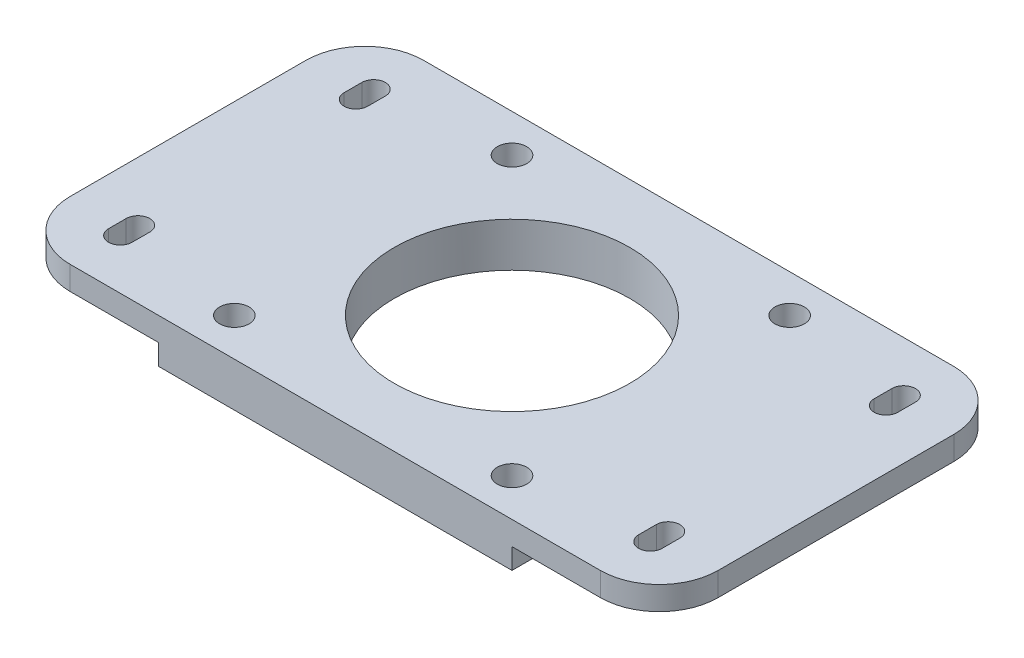
ISO-10303-21;
HEADER;
FILE_DESCRIPTION(('STEP AP214'),'2;1');
FILE_NAME('part.step','',(''),(''),'','','');
FILE_SCHEMA(('AUTOMOTIVE_DESIGN { 1 0 10303 214 1 1 1 1 }'));
ENDSEC;
DATA;
#1=APPLICATION_CONTEXT('core data for automotive mechanical design processes');
#2=APPLICATION_PROTOCOL_DEFINITION('international standard','automotive_design',2000,#1);
#3=PRODUCT_CONTEXT('',#1,'mechanical');
#4=PRODUCT('Part','Part','',(#3));
#5=PRODUCT_RELATED_PRODUCT_CATEGORY('part','',(#4));
#6=PRODUCT_DEFINITION_FORMATION('','',#4);
#7=PRODUCT_DEFINITION_CONTEXT('part definition',#1,'design');
#8=PRODUCT_DEFINITION('design','',#6,#7);
#9=PRODUCT_DEFINITION_SHAPE('','',#8);
#10=(LENGTH_UNIT() NAMED_UNIT(*) SI_UNIT(.MILLI.,.METRE.));
#11=(NAMED_UNIT(*) PLANE_ANGLE_UNIT() SI_UNIT($,.RADIAN.));
#12=(NAMED_UNIT(*) SI_UNIT($,.STERADIAN.) SOLID_ANGLE_UNIT());
#13=UNCERTAINTY_MEASURE_WITH_UNIT(LENGTH_MEASURE(1.E-05),#10,'distance_accuracy_value','');
#14=(GEOMETRIC_REPRESENTATION_CONTEXT(3) GLOBAL_UNCERTAINTY_ASSIGNED_CONTEXT((#13)) GLOBAL_UNIT_ASSIGNED_CONTEXT((#10,
#11,#12)) REPRESENTATION_CONTEXT('',''));
#15=CARTESIAN_POINT('',(0.,0.,0.));
#16=DIRECTION('',(0.,0.,1.));
#17=DIRECTION('',(1.,0.,0.));
#18=AXIS2_PLACEMENT_3D('',#15,#16,#17);
#19=CARTESIAN_POINT('',(0.,0.,0.));
#20=DIRECTION('',(0.,-1.,0.));
#21=DIRECTION('',(0.,0.,-1.));
#22=AXIS2_PLACEMENT_3D('',#19,#20,#21);
#23=PLANE('',#22);
#24=CARTESIAN_POINT('',(-23.57,0.,23.5699999999967));
#25=DIRECTION('',(0.,-1.,0.));
#26=DIRECTION('',(0.,0.,-1.));
#27=AXIS2_PLACEMENT_3D('',#24,#25,#26);
#28=CIRCLE('',#27,2.5);
#29=CARTESIAN_POINT('',(-23.57,0.,21.0699999999967));
#30=VERTEX_POINT('',#29);
#31=EDGE_CURVE('E594',#30,#30,#28,.T.);
#32=ORIENTED_EDGE('',*,*,#31,.F.);
#33=EDGE_LOOP('',(#32));
#34=FACE_BOUND('',#33,.T.);
#35=CARTESIAN_POINT('',(23.57,0.,23.5699999999967));
#36=DIRECTION('',(0.,-1.,0.));
#37=DIRECTION('',(0.,0.,-1.));
#38=AXIS2_PLACEMENT_3D('',#35,#36,#37);
#39=CIRCLE('',#38,2.5);
#40=CARTESIAN_POINT('',(23.57,0.,21.0699999999967));
#41=VERTEX_POINT('',#40);
#42=EDGE_CURVE('E596',#41,#41,#39,.T.);
#43=ORIENTED_EDGE('',*,*,#42,.F.);
#44=EDGE_LOOP('',(#43));
#45=FACE_BOUND('',#44,.T.);
#46=CARTESIAN_POINT('',(23.57,0.,-23.5700000000033));
#47=DIRECTION('',(0.,-1.,0.));
#48=DIRECTION('',(0.,0.,-1.));
#49=AXIS2_PLACEMENT_3D('',#46,#47,#48);
#50=CIRCLE('',#49,2.5);
#51=CARTESIAN_POINT('',(23.57,0.,-26.0700000000033));
#52=VERTEX_POINT('',#51);
#53=EDGE_CURVE('E601',#52,#52,#50,.T.);
#54=ORIENTED_EDGE('',*,*,#53,.F.);
#55=EDGE_LOOP('',(#54));
#56=FACE_BOUND('',#55,.T.);
#57=CARTESIAN_POINT('',(-23.57,0.,-23.5700000000033));
#58=DIRECTION('',(0.,-1.,0.));
#59=DIRECTION('',(0.,0.,-1.));
#60=AXIS2_PLACEMENT_3D('',#57,#58,#59);
#61=CIRCLE('',#60,2.5);
#62=CARTESIAN_POINT('',(-23.57,0.,-26.0700000000033));
#63=VERTEX_POINT('',#62);
#64=EDGE_CURVE('E604',#63,#63,#61,.T.);
#65=ORIENTED_EDGE('',*,*,#64,.F.);
#66=EDGE_LOOP('',(#65));
#67=FACE_BOUND('',#66,.T.);
#68=DIRECTION('',(0.,0.,-1.));
#69=VECTOR('',#68,1.);
#70=CARTESIAN_POINT('',(30.,0.,30.));
#71=LINE('',#70,#69);
#72=CARTESIAN_POINT('',(30.,0.,30.));
#73=VERTEX_POINT('',#72);
#74=CARTESIAN_POINT('',(30.,0.,-30.));
#75=VERTEX_POINT('',#74);
#76=EDGE_CURVE('E633',#73,#75,#71,.T.);
#77=ORIENTED_EDGE('',*,*,#76,.F.);
#78=DIRECTION('',(1.,0.,0.));
#79=VECTOR('',#78,1.);
#80=CARTESIAN_POINT('',(-30.,0.,30.));
#81=LINE('',#80,#79);
#82=CARTESIAN_POINT('',(-30.,0.,30.));
#83=VERTEX_POINT('',#82);
#84=EDGE_CURVE('E74',#83,#73,#81,.T.);
#85=ORIENTED_EDGE('',*,*,#84,.F.);
#86=DIRECTION('',(0.,0.,1.));
#87=VECTOR('',#86,1.);
#88=CARTESIAN_POINT('',(-30.,0.,30.));
#89=LINE('',#88,#87);
#90=CARTESIAN_POINT('',(-30.,0.,-30.));
#91=VERTEX_POINT('',#90);
#92=EDGE_CURVE('E71',#91,#83,#89,.T.);
#93=ORIENTED_EDGE('',*,*,#92,.F.);
#94=DIRECTION('',(-1.,0.,0.));
#95=VECTOR('',#94,1.);
#96=CARTESIAN_POINT('',(-30.,0.,-30.));
#97=LINE('',#96,#95);
#98=EDGE_CURVE('E636',#75,#91,#97,.T.);
#99=ORIENTED_EDGE('',*,*,#98,.F.);
#100=EDGE_LOOP('',(#77,#85,#93,#99));
#101=FACE_BOUND('',#100,.T.);
#102=CARTESIAN_POINT('',(0.,0.,0.));
#103=DIRECTION('',(0.,1.,0.));
#104=DIRECTION('',(0.,0.,1.));
#105=AXIS2_PLACEMENT_3D('',#102,#103,#104);
#106=CIRCLE('',#105,20.);
#107=CARTESIAN_POINT('',(0.,0.,20.));
#108=VERTEX_POINT('',#107);
#109=EDGE_CURVE('E427',#108,#108,#106,.T.);
#110=ORIENTED_EDGE('',*,*,#109,.T.);
#111=EDGE_LOOP('',(#110));
#112=FACE_BOUND('',#111,.T.);
#113=ADVANCED_FACE('F33',(#34,#45,#56,#67,#101,#112),#23,.T.);
#114=CARTESIAN_POINT('',(30.,3.5,30.));
#115=DIRECTION('',(-1.,0.,0.));
#116=DIRECTION('',(0.,0.,1.));
#117=AXIS2_PLACEMENT_3D('',#114,#115,#116);
#118=PLANE('',#117);
#119=ORIENTED_EDGE('',*,*,#76,.T.);
#120=DIRECTION('',(0.,-1.,0.));
#121=VECTOR('',#120,1.);
#122=CARTESIAN_POINT('',(30.,3.5,-30.));
#123=LINE('',#122,#121);
#124=CARTESIAN_POINT('',(30.,3.5,-30.));
#125=VERTEX_POINT('',#124);
#126=EDGE_CURVE('E11',#125,#75,#123,.T.);
#127=ORIENTED_EDGE('',*,*,#126,.F.);
#128=DIRECTION('',(0.,0.,-1.));
#129=VECTOR('',#128,1.);
#130=CARTESIAN_POINT('',(30.,3.5,30.));
#131=LINE('',#130,#129);
#132=CARTESIAN_POINT('',(30.,3.5,30.));
#133=VERTEX_POINT('',#132);
#134=EDGE_CURVE('E643',#133,#125,#131,.T.);
#135=ORIENTED_EDGE('',*,*,#134,.F.);
#136=DIRECTION('',(0.,-1.,0.));
#137=VECTOR('',#136,1.);
#138=CARTESIAN_POINT('',(30.,3.5,30.));
#139=LINE('',#138,#137);
#140=EDGE_CURVE('E52',#133,#73,#139,.T.);
#141=ORIENTED_EDGE('',*,*,#140,.T.);
#142=EDGE_LOOP('',(#119,#127,#135,#141));
#143=FACE_BOUND('',#142,.T.);
#144=ADVANCED_FACE('F35',(#143),#118,.F.);
#145=CARTESIAN_POINT('',(-30.,3.5,-30.));
#146=DIRECTION('',(0.,0.,1.));
#147=DIRECTION('',(1.,0.,0.));
#148=AXIS2_PLACEMENT_3D('',#145,#146,#147);
#149=PLANE('',#148);
#150=ORIENTED_EDGE('',*,*,#98,.T.);
#151=DIRECTION('',(0.,-1.,0.));
#152=VECTOR('',#151,1.);
#153=CARTESIAN_POINT('',(-30.,3.5,-30.));
#154=LINE('',#153,#152);
#155=CARTESIAN_POINT('',(-30.,3.5,-30.));
#156=VERTEX_POINT('',#155);
#157=EDGE_CURVE('E43',#156,#91,#154,.T.);
#158=ORIENTED_EDGE('',*,*,#157,.F.);
#159=DIRECTION('',(1.,0.,0.));
#160=VECTOR('',#159,1.);
#161=CARTESIAN_POINT('',(45.,3.5,-30.));
#162=LINE('',#161,#160);
#163=CARTESIAN_POINT('',(-45.,3.5,-30.));
#164=VERTEX_POINT('',#163);
#165=EDGE_CURVE('E407',#164,#156,#162,.T.);
#166=ORIENTED_EDGE('',*,*,#165,.F.);
#167=DIRECTION('',(0.,-1.,0.));
#168=VECTOR('',#167,1.);
#169=CARTESIAN_POINT('',(-45.,7.5,-30.));
#170=LINE('',#169,#168);
#171=CARTESIAN_POINT('',(-45.,7.5,-30.));
#172=VERTEX_POINT('',#171);
#173=EDGE_CURVE('E395',#172,#164,#170,.T.);
#174=ORIENTED_EDGE('',*,*,#173,.F.);
#175=DIRECTION('',(1.,0.,0.));
#176=VECTOR('',#175,1.);
#177=CARTESIAN_POINT('',(45.,7.5,-30.));
#178=LINE('',#177,#176);
#179=CARTESIAN_POINT('',(45.,7.5,-30.));
#180=VERTEX_POINT('',#179);
#181=EDGE_CURVE('E373',#172,#180,#178,.T.);
#182=ORIENTED_EDGE('',*,*,#181,.T.);
#183=DIRECTION('',(0.,-1.,0.));
#184=VECTOR('',#183,1.);
#185=CARTESIAN_POINT('',(45.,7.5,-30.));
#186=LINE('',#185,#184);
#187=CARTESIAN_POINT('',(45.,3.5,-30.));
#188=VERTEX_POINT('',#187);
#189=EDGE_CURVE('E411',#180,#188,#186,.T.);
#190=ORIENTED_EDGE('',*,*,#189,.T.);
#191=EDGE_CURVE('E398',#125,#188,#162,.T.);
#192=ORIENTED_EDGE('',*,*,#191,.F.);
#193=ORIENTED_EDGE('',*,*,#126,.T.);
#194=EDGE_LOOP('',(#150,#158,#166,#174,#182,#190,#192,#193));
#195=FACE_BOUND('',#194,.T.);
#196=ADVANCED_FACE('F476',(#195),#149,.F.);
#197=CARTESIAN_POINT('',(-30.,3.5,30.));
#198=DIRECTION('',(1.,0.,0.));
#199=DIRECTION('',(0.,0.,-1.));
#200=AXIS2_PLACEMENT_3D('',#197,#198,#199);
#201=PLANE('',#200);
#202=ORIENTED_EDGE('',*,*,#92,.T.);
#203=DIRECTION('',(0.,-1.,0.));
#204=VECTOR('',#203,1.);
#205=CARTESIAN_POINT('',(-30.,3.5,30.));
#206=LINE('',#205,#204);
#207=CARTESIAN_POINT('',(-30.,3.5,30.));
#208=VERTEX_POINT('',#207);
#209=EDGE_CURVE('E651',#208,#83,#206,.T.);
#210=ORIENTED_EDGE('',*,*,#209,.F.);
#211=DIRECTION('',(0.,0.,1.));
#212=VECTOR('',#211,1.);
#213=CARTESIAN_POINT('',(-30.,3.5,30.));
#214=LINE('',#213,#212);
#215=EDGE_CURVE('E645',#156,#208,#214,.T.);
#216=ORIENTED_EDGE('',*,*,#215,.F.);
#217=ORIENTED_EDGE('',*,*,#157,.T.);
#218=EDGE_LOOP('',(#202,#210,#216,#217));
#219=FACE_BOUND('',#218,.T.);
#220=ADVANCED_FACE('F468',(#219),#201,.F.);
#221=CARTESIAN_POINT('',(-30.,3.5,30.));
#222=DIRECTION('',(0.,0.,-1.));
#223=DIRECTION('',(-1.,0.,0.));
#224=AXIS2_PLACEMENT_3D('',#221,#222,#223);
#225=PLANE('',#224);
#226=ORIENTED_EDGE('',*,*,#84,.T.);
#227=ORIENTED_EDGE('',*,*,#140,.F.);
#228=DIRECTION('',(-1.,0.,0.));
#229=VECTOR('',#228,1.);
#230=CARTESIAN_POINT('',(-45.,3.5,30.));
#231=LINE('',#230,#229);
#232=CARTESIAN_POINT('',(45.,3.5,30.));
#233=VERTEX_POINT('',#232);
#234=EDGE_CURVE('E433',#233,#133,#231,.T.);
#235=ORIENTED_EDGE('',*,*,#234,.F.);
#236=DIRECTION('',(0.,-1.,0.));
#237=VECTOR('',#236,1.);
#238=CARTESIAN_POINT('',(45.,7.5,30.));
#239=LINE('',#238,#237);
#240=CARTESIAN_POINT('',(45.,7.5,30.));
#241=VERTEX_POINT('',#240);
#242=EDGE_CURVE('E418',#241,#233,#239,.T.);
#243=ORIENTED_EDGE('',*,*,#242,.F.);
#244=DIRECTION('',(-1.,0.,0.));
#245=VECTOR('',#244,1.);
#246=CARTESIAN_POINT('',(-45.,7.5,30.));
#247=LINE('',#246,#245);
#248=CARTESIAN_POINT('',(-45.,7.5,30.));
#249=VERTEX_POINT('',#248);
#250=EDGE_CURVE('E386',#241,#249,#247,.T.);
#251=ORIENTED_EDGE('',*,*,#250,.T.);
#252=DIRECTION('',(0.,-1.,0.));
#253=VECTOR('',#252,1.);
#254=CARTESIAN_POINT('',(-45.,7.5,30.));
#255=LINE('',#254,#253);
#256=CARTESIAN_POINT('',(-45.,3.5,30.));
#257=VERTEX_POINT('',#256);
#258=EDGE_CURVE('E420',#249,#257,#255,.T.);
#259=ORIENTED_EDGE('',*,*,#258,.T.);
#260=EDGE_CURVE('E439',#208,#257,#231,.T.);
#261=ORIENTED_EDGE('',*,*,#260,.F.);
#262=ORIENTED_EDGE('',*,*,#209,.T.);
#263=EDGE_LOOP('',(#226,#227,#235,#243,#251,#259,#261,#262));
#264=FACE_BOUND('',#263,.T.);
#265=ADVANCED_FACE('F465',(#264),#225,.F.);
#266=CARTESIAN_POINT('',(0.,3.5,0.));
#267=DIRECTION('',(0.,-1.,0.));
#268=DIRECTION('',(0.,0.,-1.));
#269=AXIS2_PLACEMENT_3D('',#266,#267,#268);
#270=CYLINDRICAL_SURFACE('',#269,20.);
#271=ORIENTED_EDGE('',*,*,#109,.F.);
#272=EDGE_LOOP('',(#271));
#273=FACE_BOUND('',#272,.T.);
#274=CARTESIAN_POINT('',(0.,7.5,0.));
#275=DIRECTION('',(0.,-1.,0.));
#276=DIRECTION('',(0.,0.,-1.));
#277=AXIS2_PLACEMENT_3D('',#274,#275,#276);
#278=CIRCLE('',#277,20.);
#279=CARTESIAN_POINT('',(0.,7.5,-20.));
#280=VERTEX_POINT('',#279);
#281=EDGE_CURVE('E258',#280,#280,#278,.T.);
#282=ORIENTED_EDGE('',*,*,#281,.F.);
#283=EDGE_LOOP('',(#282));
#284=FACE_BOUND('',#283,.T.);
#285=ADVANCED_FACE('F467',(#273,#284),#270,.F.);
#286=CARTESIAN_POINT('',(-45.,3.5,-20.));
#287=DIRECTION('',(0.,1.,0.));
#288=DIRECTION('',(0.,0.,1.));
#289=AXIS2_PLACEMENT_3D('',#286,#287,#288);
#290=PLANE('',#289);
#291=DIRECTION('',(0.,0.,1.));
#292=VECTOR('',#291,1.);
#293=CARTESIAN_POINT('',(47.,3.5,-18.5));
#294=LINE('',#293,#292);
#295=CARTESIAN_POINT('',(47.,3.5,-21.5));
#296=VERTEX_POINT('',#295);
#297=CARTESIAN_POINT('',(47.,3.5,-18.5));
#298=VERTEX_POINT('',#297);
#299=EDGE_CURVE('E289',#296,#298,#294,.T.);
#300=ORIENTED_EDGE('',*,*,#299,.F.);
#301=CARTESIAN_POINT('',(45.,3.5,-21.5));
#302=DIRECTION('',(0.,-1.,0.));
#303=DIRECTION('',(0.,0.,1.));
#304=AXIS2_PLACEMENT_3D('',#301,#302,#303);
#305=CIRCLE('',#304,1.99999999999999);
#306=CARTESIAN_POINT('',(43.,3.5,-21.5));
#307=VERTEX_POINT('',#306);
#308=EDGE_CURVE('E270',#307,#296,#305,.T.);
#309=ORIENTED_EDGE('',*,*,#308,.F.);
#310=DIRECTION('',(0.,0.,-1.));
#311=VECTOR('',#310,1.);
#312=CARTESIAN_POINT('',(43.,3.5,-21.5));
#313=LINE('',#312,#311);
#314=CARTESIAN_POINT('',(43.,3.5,-18.5));
#315=VERTEX_POINT('',#314);
#316=EDGE_CURVE('E278',#315,#307,#313,.T.);
#317=ORIENTED_EDGE('',*,*,#316,.F.);
#318=CARTESIAN_POINT('',(45.,3.5,-18.5));
#319=DIRECTION('',(0.,-1.,0.));
#320=DIRECTION('',(0.,0.,1.));
#321=AXIS2_PLACEMENT_3D('',#318,#319,#320);
#322=CIRCLE('',#321,1.99999999999999);
#323=EDGE_CURVE('E292',#298,#315,#322,.T.);
#324=ORIENTED_EDGE('',*,*,#323,.F.);
#325=EDGE_LOOP('',(#300,#309,#317,#324));
#326=FACE_BOUND('',#325,.T.);
#327=DIRECTION('',(0.,0.,1.));
#328=VECTOR('',#327,1.);
#329=CARTESIAN_POINT('',(47.,3.5,18.5));
#330=LINE('',#329,#328);
#331=CARTESIAN_POINT('',(47.,3.5,18.5));
#332=VERTEX_POINT('',#331);
#333=CARTESIAN_POINT('',(47.,3.5,21.5));
#334=VERTEX_POINT('',#333);
#335=EDGE_CURVE('E264',#332,#334,#330,.T.);
#336=ORIENTED_EDGE('',*,*,#335,.F.);
#337=CARTESIAN_POINT('',(45.,3.5,18.5));
#338=DIRECTION('',(0.,-1.,0.));
#339=DIRECTION('',(0.,0.,-1.));
#340=AXIS2_PLACEMENT_3D('',#337,#338,#339);
#341=CIRCLE('',#340,1.99999999999999);
#342=CARTESIAN_POINT('',(43.,3.5,18.5));
#343=VERTEX_POINT('',#342);
#344=EDGE_CURVE('E234',#343,#332,#341,.T.);
#345=ORIENTED_EDGE('',*,*,#344,.F.);
#346=DIRECTION('',(0.,0.,-1.));
#347=VECTOR('',#346,1.);
#348=CARTESIAN_POINT('',(43.,3.5,21.5));
#349=LINE('',#348,#347);
#350=CARTESIAN_POINT('',(43.,3.5,21.5));
#351=VERTEX_POINT('',#350);
#352=EDGE_CURVE('E252',#351,#343,#349,.T.);
#353=ORIENTED_EDGE('',*,*,#352,.F.);
#354=CARTESIAN_POINT('',(45.,3.5,21.5));
#355=DIRECTION('',(0.,-1.,0.));
#356=DIRECTION('',(0.,0.,-1.));
#357=AXIS2_PLACEMENT_3D('',#354,#355,#356);
#358=CIRCLE('',#357,1.99999999999999);
#359=EDGE_CURVE('E255',#334,#351,#358,.T.);
#360=ORIENTED_EDGE('',*,*,#359,.F.);
#361=EDGE_LOOP('',(#336,#345,#353,#360));
#362=FACE_BOUND('',#361,.T.);
#363=ORIENTED_EDGE('',*,*,#234,.T.);
#364=ORIENTED_EDGE('',*,*,#134,.T.);
#365=ORIENTED_EDGE('',*,*,#191,.T.);
#366=CARTESIAN_POINT('',(45.,3.5,-20.));
#367=DIRECTION('',(0.,-1.,0.));
#368=DIRECTION('',(0.,0.,-1.));
#369=AXIS2_PLACEMENT_3D('',#366,#367,#368);
#370=CIRCLE('',#369,9.99999999999999);
#371=CARTESIAN_POINT('',(55.,3.5,-20.));
#372=VERTEX_POINT('',#371);
#373=EDGE_CURVE('E401',#188,#372,#370,.T.);
#374=ORIENTED_EDGE('',*,*,#373,.T.);
#375=DIRECTION('',(0.,0.,1.));
#376=VECTOR('',#375,1.);
#377=CARTESIAN_POINT('',(55.,3.5,-20.));
#378=LINE('',#377,#376);
#379=CARTESIAN_POINT('',(55.,3.5,20.));
#380=VERTEX_POINT('',#379);
#381=EDGE_CURVE('E447',#372,#380,#378,.T.);
#382=ORIENTED_EDGE('',*,*,#381,.T.);
#383=CARTESIAN_POINT('',(45.,3.5,20.));
#384=DIRECTION('',(0.,-1.,0.));
#385=DIRECTION('',(0.,0.,-1.));
#386=AXIS2_PLACEMENT_3D('',#383,#384,#385);
#387=CIRCLE('',#386,9.99999999999999);
#388=EDGE_CURVE('E436',#380,#233,#387,.T.);
#389=ORIENTED_EDGE('',*,*,#388,.T.);
#390=EDGE_LOOP('',(#363,#364,#365,#374,#382,#389));
#391=FACE_BOUND('',#390,.T.);
#392=ADVANCED_FACE('F453',(#326,#362,#391),#290,.F.);
#393=DIRECTION('',(0.,0.,-1.));
#394=VECTOR('',#393,1.);
#395=CARTESIAN_POINT('',(-47.,3.5,-18.5));
#396=LINE('',#395,#394);
#397=CARTESIAN_POINT('',(-47.,3.5,-18.5));
#398=VERTEX_POINT('',#397);
#399=CARTESIAN_POINT('',(-47.,3.5,-21.5));
#400=VERTEX_POINT('',#399);
#401=EDGE_CURVE('E353',#398,#400,#396,.T.);
#402=ORIENTED_EDGE('',*,*,#401,.F.);
#403=CARTESIAN_POINT('',(-45.,3.5,-18.5));
#404=DIRECTION('',(0.,-1.,0.));
#405=DIRECTION('',(0.,0.,-1.));
#406=AXIS2_PLACEMENT_3D('',#403,#404,#405);
#407=CIRCLE('',#406,1.99999999999999);
#408=CARTESIAN_POINT('',(-43.,3.5,-18.5));
#409=VERTEX_POINT('',#408);
#410=EDGE_CURVE('E331',#409,#398,#407,.T.);
#411=ORIENTED_EDGE('',*,*,#410,.F.);
#412=DIRECTION('',(0.,0.,1.));
#413=VECTOR('',#412,1.);
#414=CARTESIAN_POINT('',(-43.,3.5,-21.5));
#415=LINE('',#414,#413);
#416=CARTESIAN_POINT('',(-43.,3.5,-21.5));
#417=VERTEX_POINT('',#416);
#418=EDGE_CURVE('E342',#417,#409,#415,.T.);
#419=ORIENTED_EDGE('',*,*,#418,.F.);
#420=CARTESIAN_POINT('',(-45.,3.5,-21.5));
#421=DIRECTION('',(0.,-1.,0.));
#422=DIRECTION('',(0.,0.,-1.));
#423=AXIS2_PLACEMENT_3D('',#420,#421,#422);
#424=CIRCLE('',#423,1.99999999999999);
#425=EDGE_CURVE('E356',#400,#417,#424,.T.);
#426=ORIENTED_EDGE('',*,*,#425,.F.);
#427=EDGE_LOOP('',(#402,#411,#419,#426));
#428=FACE_BOUND('',#427,.T.);
#429=DIRECTION('',(0.,0.,-1.));
#430=VECTOR('',#429,1.);
#431=CARTESIAN_POINT('',(-47.,3.5,18.5));
#432=LINE('',#431,#430);
#433=CARTESIAN_POINT('',(-47.,3.5,21.5));
#434=VERTEX_POINT('',#433);
#435=CARTESIAN_POINT('',(-47.,3.5,18.5));
#436=VERTEX_POINT('',#435);
#437=EDGE_CURVE('E321',#434,#436,#432,.T.);
#438=ORIENTED_EDGE('',*,*,#437,.F.);
#439=CARTESIAN_POINT('',(-45.,3.5,21.5));
#440=DIRECTION('',(0.,-1.,0.));
#441=DIRECTION('',(0.,0.,1.));
#442=AXIS2_PLACEMENT_3D('',#439,#440,#441);
#443=CIRCLE('',#442,1.99999999999999);
#444=CARTESIAN_POINT('',(-43.,3.5,21.5));
#445=VERTEX_POINT('',#444);
#446=EDGE_CURVE('E299',#445,#434,#443,.T.);
#447=ORIENTED_EDGE('',*,*,#446,.F.);
#448=DIRECTION('',(0.,0.,1.));
#449=VECTOR('',#448,1.);
#450=CARTESIAN_POINT('',(-43.,3.5,21.5));
#451=LINE('',#450,#449);
#452=CARTESIAN_POINT('',(-43.,3.5,18.5));
#453=VERTEX_POINT('',#452);
#454=EDGE_CURVE('E310',#453,#445,#451,.T.);
#455=ORIENTED_EDGE('',*,*,#454,.F.);
#456=CARTESIAN_POINT('',(-45.,3.5,18.5));
#457=DIRECTION('',(0.,-1.,0.));
#458=DIRECTION('',(0.,0.,1.));
#459=AXIS2_PLACEMENT_3D('',#456,#457,#458);
#460=CIRCLE('',#459,1.99999999999999);
#461=EDGE_CURVE('E324',#436,#453,#460,.T.);
#462=ORIENTED_EDGE('',*,*,#461,.F.);
#463=EDGE_LOOP('',(#438,#447,#455,#462));
#464=FACE_BOUND('',#463,.T.);
#465=ORIENTED_EDGE('',*,*,#165,.T.);
#466=ORIENTED_EDGE('',*,*,#215,.T.);
#467=ORIENTED_EDGE('',*,*,#260,.T.);
#468=CARTESIAN_POINT('',(-45.,3.5,20.));
#469=DIRECTION('',(0.,-1.,0.));
#470=DIRECTION('',(0.,0.,1.));
#471=AXIS2_PLACEMENT_3D('',#468,#469,#470);
#472=CIRCLE('',#471,9.99999999999999);
#473=CARTESIAN_POINT('',(-55.,3.5,20.));
#474=VERTEX_POINT('',#473);
#475=EDGE_CURVE('E430',#257,#474,#472,.T.);
#476=ORIENTED_EDGE('',*,*,#475,.T.);
#477=DIRECTION('',(0.,0.,-1.));
#478=VECTOR('',#477,1.);
#479=CARTESIAN_POINT('',(-55.,3.5,-20.));
#480=LINE('',#479,#478);
#481=CARTESIAN_POINT('',(-55.,3.5,-20.));
#482=VERTEX_POINT('',#481);
#483=EDGE_CURVE('E374',#474,#482,#480,.T.);
#484=ORIENTED_EDGE('',*,*,#483,.T.);
#485=CARTESIAN_POINT('',(-45.,3.5,-20.));
#486=DIRECTION('',(0.,-1.,0.));
#487=DIRECTION('',(0.,0.,1.));
#488=AXIS2_PLACEMENT_3D('',#485,#486,#487);
#489=CIRCLE('',#488,9.99999999999999);
#490=EDGE_CURVE('E363',#482,#164,#489,.T.);
#491=ORIENTED_EDGE('',*,*,#490,.T.);
#492=EDGE_LOOP('',(#465,#466,#467,#476,#484,#491));
#493=FACE_BOUND('',#492,.T.);
#494=ADVANCED_FACE('F493',(#428,#464,#493),#290,.F.);
#495=CARTESIAN_POINT('',(-45.,7.5,-20.));
#496=DIRECTION('',(0.,-1.,0.));
#497=DIRECTION('',(0.,0.,-1.));
#498=AXIS2_PLACEMENT_3D('',#495,#496,#497);
#499=CYLINDRICAL_SURFACE('',#498,9.99999999999999);
#500=ORIENTED_EDGE('',*,*,#490,.F.);
#501=DIRECTION('',(0.,-1.,0.));
#502=VECTOR('',#501,1.);
#503=CARTESIAN_POINT('',(-55.,7.5,-20.));
#504=LINE('',#503,#502);
#505=CARTESIAN_POINT('',(-55.,7.5,-20.));
#506=VERTEX_POINT('',#505);
#507=EDGE_CURVE('E425',#506,#482,#504,.T.);
#508=ORIENTED_EDGE('',*,*,#507,.F.);
#509=CARTESIAN_POINT('',(-45.,7.5,-20.));
#510=DIRECTION('',(0.,-1.,0.));
#511=DIRECTION('',(0.,0.,1.));
#512=AXIS2_PLACEMENT_3D('',#509,#510,#511);
#513=CIRCLE('',#512,9.99999999999999);
#514=EDGE_CURVE('E370',#506,#172,#513,.T.);
#515=ORIENTED_EDGE('',*,*,#514,.T.);
#516=ORIENTED_EDGE('',*,*,#173,.T.);
#517=EDGE_LOOP('',(#500,#508,#515,#516));
#518=FACE_BOUND('',#517,.T.);
#519=ADVANCED_FACE('F489',(#518),#499,.T.);
#520=CARTESIAN_POINT('',(-55.,7.5,-20.));
#521=DIRECTION('',(-1.,0.,0.));
#522=DIRECTION('',(0.,0.,1.));
#523=AXIS2_PLACEMENT_3D('',#520,#521,#522);
#524=PLANE('',#523);
#525=ORIENTED_EDGE('',*,*,#483,.F.);
#526=DIRECTION('',(0.,-1.,0.));
#527=VECTOR('',#526,1.);
#528=CARTESIAN_POINT('',(-55.,7.5,20.));
#529=LINE('',#528,#527);
#530=CARTESIAN_POINT('',(-55.,7.5,20.));
#531=VERTEX_POINT('',#530);
#532=EDGE_CURVE('E423',#531,#474,#529,.T.);
#533=ORIENTED_EDGE('',*,*,#532,.F.);
#534=DIRECTION('',(0.,0.,-1.));
#535=VECTOR('',#534,1.);
#536=CARTESIAN_POINT('',(-55.,7.5,-20.));
#537=LINE('',#536,#535);
#538=EDGE_CURVE('E392',#531,#506,#537,.T.);
#539=ORIENTED_EDGE('',*,*,#538,.T.);
#540=ORIENTED_EDGE('',*,*,#507,.T.);
#541=EDGE_LOOP('',(#525,#533,#539,#540));
#542=FACE_BOUND('',#541,.T.);
#543=ADVANCED_FACE('F492',(#542),#524,.T.);
#544=CARTESIAN_POINT('',(-45.,7.5,20.));
#545=DIRECTION('',(0.,-1.,0.));
#546=DIRECTION('',(0.,0.,-1.));
#547=AXIS2_PLACEMENT_3D('',#544,#545,#546);
#548=CYLINDRICAL_SURFACE('',#547,9.99999999999999);
#549=ORIENTED_EDGE('',*,*,#475,.F.);
#550=ORIENTED_EDGE('',*,*,#258,.F.);
#551=CARTESIAN_POINT('',(-45.,7.5,20.));
#552=DIRECTION('',(0.,-1.,0.));
#553=DIRECTION('',(0.,0.,1.));
#554=AXIS2_PLACEMENT_3D('',#551,#552,#553);
#555=CIRCLE('',#554,9.99999999999999);
#556=EDGE_CURVE('E389',#249,#531,#555,.T.);
#557=ORIENTED_EDGE('',*,*,#556,.T.);
#558=ORIENTED_EDGE('',*,*,#532,.T.);
#559=EDGE_LOOP('',(#549,#550,#557,#558));
#560=FACE_BOUND('',#559,.T.);
#561=ADVANCED_FACE('F501',(#560),#548,.T.);
#562=CARTESIAN_POINT('',(45.,7.5,20.));
#563=DIRECTION('',(0.,-1.,0.));
#564=DIRECTION('',(0.,0.,-1.));
#565=AXIS2_PLACEMENT_3D('',#562,#563,#564);
#566=CYLINDRICAL_SURFACE('',#565,9.99999999999999);
#567=ORIENTED_EDGE('',*,*,#388,.F.);
#568=DIRECTION('',(0.,-1.,0.));
#569=VECTOR('',#568,1.);
#570=CARTESIAN_POINT('',(55.,7.5,20.));
#571=LINE('',#570,#569);
#572=CARTESIAN_POINT('',(55.,7.5,20.));
#573=VERTEX_POINT('',#572);
#574=EDGE_CURVE('E416',#573,#380,#571,.T.);
#575=ORIENTED_EDGE('',*,*,#574,.F.);
#576=CARTESIAN_POINT('',(45.,7.5,20.));
#577=DIRECTION('',(0.,-1.,0.));
#578=DIRECTION('',(0.,0.,-1.));
#579=AXIS2_PLACEMENT_3D('',#576,#577,#578);
#580=CIRCLE('',#579,9.99999999999999);
#581=EDGE_CURVE('E383',#573,#241,#580,.T.);
#582=ORIENTED_EDGE('',*,*,#581,.T.);
#583=ORIENTED_EDGE('',*,*,#242,.T.);
#584=EDGE_LOOP('',(#567,#575,#582,#583));
#585=FACE_BOUND('',#584,.T.);
#586=ADVANCED_FACE('F463',(#585),#566,.T.);
#587=CARTESIAN_POINT('',(55.,7.5,-20.));
#588=DIRECTION('',(1.,0.,0.));
#589=DIRECTION('',(0.,0.,-1.));
#590=AXIS2_PLACEMENT_3D('',#587,#588,#589);
#591=PLANE('',#590);
#592=ORIENTED_EDGE('',*,*,#381,.F.);
#593=DIRECTION('',(0.,-1.,0.));
#594=VECTOR('',#593,1.);
#595=CARTESIAN_POINT('',(55.,7.5,-20.));
#596=LINE('',#595,#594);
#597=CARTESIAN_POINT('',(55.,7.5,-20.));
#598=VERTEX_POINT('',#597);
#599=EDGE_CURVE('E414',#598,#372,#596,.T.);
#600=ORIENTED_EDGE('',*,*,#599,.F.);
#601=DIRECTION('',(0.,0.,1.));
#602=VECTOR('',#601,1.);
#603=CARTESIAN_POINT('',(55.,7.5,-20.));
#604=LINE('',#603,#602);
#605=EDGE_CURVE('E380',#598,#573,#604,.T.);
#606=ORIENTED_EDGE('',*,*,#605,.T.);
#607=ORIENTED_EDGE('',*,*,#574,.T.);
#608=EDGE_LOOP('',(#592,#600,#606,#607));
#609=FACE_BOUND('',#608,.T.);
#610=ADVANCED_FACE('F460',(#609),#591,.T.);
#611=CARTESIAN_POINT('',(45.,7.5,-20.));
#612=DIRECTION('',(0.,-1.,0.));
#613=DIRECTION('',(0.,0.,-1.));
#614=AXIS2_PLACEMENT_3D('',#611,#612,#613);
#615=CYLINDRICAL_SURFACE('',#614,9.99999999999999);
#616=ORIENTED_EDGE('',*,*,#373,.F.);
#617=ORIENTED_EDGE('',*,*,#189,.F.);
#618=CARTESIAN_POINT('',(45.,7.5,-20.));
#619=DIRECTION('',(0.,-1.,0.));
#620=DIRECTION('',(0.,0.,-1.));
#621=AXIS2_PLACEMENT_3D('',#618,#619,#620);
#622=CIRCLE('',#621,9.99999999999999);
#623=EDGE_CURVE('E377',#180,#598,#622,.T.);
#624=ORIENTED_EDGE('',*,*,#623,.T.);
#625=ORIENTED_EDGE('',*,*,#599,.T.);
#626=EDGE_LOOP('',(#616,#617,#624,#625));
#627=FACE_BOUND('',#626,.T.);
#628=ADVANCED_FACE('F456',(#627),#615,.T.);
#629=CARTESIAN_POINT('',(-45.,7.5,-20.));
#630=DIRECTION('',(0.,1.,0.));
#631=DIRECTION('',(0.,0.,1.));
#632=AXIS2_PLACEMENT_3D('',#629,#630,#631);
#633=PLANE('',#632);
#634=CARTESIAN_POINT('',(-23.57,7.5,23.5699999999967));
#635=DIRECTION('',(0.,1.,0.));
#636=DIRECTION('',(0.,0.,1.));
#637=AXIS2_PLACEMENT_3D('',#634,#635,#636);
#638=CIRCLE('',#637,2.5);
#639=CARTESIAN_POINT('',(-23.57,7.5,26.0699999999967));
#640=VERTEX_POINT('',#639);
#641=EDGE_CURVE('E37',#640,#640,#638,.T.);
#642=ORIENTED_EDGE('',*,*,#641,.F.);
#643=EDGE_LOOP('',(#642));
#644=FACE_BOUND('',#643,.T.);
#645=CARTESIAN_POINT('',(23.57,7.5,23.5699999999967));
#646=DIRECTION('',(0.,1.,0.));
#647=DIRECTION('',(0.,0.,1.));
#648=AXIS2_PLACEMENT_3D('',#645,#646,#647);
#649=CIRCLE('',#648,2.5);
#650=CARTESIAN_POINT('',(23.57,7.5,26.0699999999967));
#651=VERTEX_POINT('',#650);
#652=EDGE_CURVE('E600',#651,#651,#649,.T.);
#653=ORIENTED_EDGE('',*,*,#652,.F.);
#654=EDGE_LOOP('',(#653));
#655=FACE_BOUND('',#654,.T.);
#656=CARTESIAN_POINT('',(23.57,7.5,-23.5700000000033));
#657=DIRECTION('',(0.,1.,0.));
#658=DIRECTION('',(0.,0.,1.));
#659=AXIS2_PLACEMENT_3D('',#656,#657,#658);
#660=CIRCLE('',#659,2.5);
#661=CARTESIAN_POINT('',(23.57,7.5,-21.0700000000033));
#662=VERTEX_POINT('',#661);
#663=EDGE_CURVE('E603',#662,#662,#660,.T.);
#664=ORIENTED_EDGE('',*,*,#663,.F.);
#665=EDGE_LOOP('',(#664));
#666=FACE_BOUND('',#665,.T.);
#667=CARTESIAN_POINT('',(-23.57,7.5,-23.5700000000033));
#668=DIRECTION('',(0.,1.,0.));
#669=DIRECTION('',(0.,0.,1.));
#670=AXIS2_PLACEMENT_3D('',#667,#668,#669);
#671=CIRCLE('',#670,2.5);
#672=CARTESIAN_POINT('',(-23.57,7.5,-21.0700000000033));
#673=VERTEX_POINT('',#672);
#674=EDGE_CURVE('E606',#673,#673,#671,.T.);
#675=ORIENTED_EDGE('',*,*,#674,.F.);
#676=EDGE_LOOP('',(#675));
#677=FACE_BOUND('',#676,.T.);
#678=ORIENTED_EDGE('',*,*,#281,.T.);
#679=EDGE_LOOP('',(#678));
#680=FACE_BOUND('',#679,.T.);
#681=CARTESIAN_POINT('',(45.,7.5,18.5));
#682=DIRECTION('',(0.,-1.,0.));
#683=DIRECTION('',(0.,0.,-1.));
#684=AXIS2_PLACEMENT_3D('',#681,#682,#683);
#685=CIRCLE('',#684,1.99999999999999);
#686=CARTESIAN_POINT('',(43.,7.5,18.5));
#687=VERTEX_POINT('',#686);
#688=CARTESIAN_POINT('',(47.,7.5,18.5));
#689=VERTEX_POINT('',#688);
#690=EDGE_CURVE('E231',#687,#689,#685,.T.);
#691=ORIENTED_EDGE('',*,*,#690,.T.);
#692=DIRECTION('',(0.,0.,1.));
#693=VECTOR('',#692,1.);
#694=CARTESIAN_POINT('',(47.,7.5,18.5));
#695=LINE('',#694,#693);
#696=CARTESIAN_POINT('',(47.,7.5,21.5));
#697=VERTEX_POINT('',#696);
#698=EDGE_CURVE('E243',#689,#697,#695,.T.);
#699=ORIENTED_EDGE('',*,*,#698,.T.);
#700=CARTESIAN_POINT('',(45.,7.5,21.5));
#701=DIRECTION('',(0.,-1.,0.));
#702=DIRECTION('',(0.,0.,-1.));
#703=AXIS2_PLACEMENT_3D('',#700,#701,#702);
#704=CIRCLE('',#703,1.99999999999999);
#705=CARTESIAN_POINT('',(43.,7.5,21.5));
#706=VERTEX_POINT('',#705);
#707=EDGE_CURVE('E247',#697,#706,#704,.T.);
#708=ORIENTED_EDGE('',*,*,#707,.T.);
#709=DIRECTION('',(0.,0.,-1.));
#710=VECTOR('',#709,1.);
#711=CARTESIAN_POINT('',(43.,7.5,21.5));
#712=LINE('',#711,#710);
#713=EDGE_CURVE('E239',#706,#687,#712,.T.);
#714=ORIENTED_EDGE('',*,*,#713,.T.);
#715=EDGE_LOOP('',(#691,#699,#708,#714));
#716=FACE_BOUND('',#715,.T.);
#717=CARTESIAN_POINT('',(45.,7.5,-21.5));
#718=DIRECTION('',(0.,-1.,0.));
#719=DIRECTION('',(0.,0.,1.));
#720=AXIS2_PLACEMENT_3D('',#717,#718,#719);
#721=CIRCLE('',#720,1.99999999999999);
#722=CARTESIAN_POINT('',(43.,7.5,-21.5));
#723=VERTEX_POINT('',#722);
#724=CARTESIAN_POINT('',(47.,7.5,-21.5));
#725=VERTEX_POINT('',#724);
#726=EDGE_CURVE('E274',#723,#725,#721,.T.);
#727=ORIENTED_EDGE('',*,*,#726,.T.);
#728=DIRECTION('',(0.,0.,1.));
#729=VECTOR('',#728,1.);
#730=CARTESIAN_POINT('',(47.,7.5,-18.5));
#731=LINE('',#730,#729);
#732=CARTESIAN_POINT('',(47.,7.5,-18.5));
#733=VERTEX_POINT('',#732);
#734=EDGE_CURVE('E277',#725,#733,#731,.T.);
#735=ORIENTED_EDGE('',*,*,#734,.T.);
#736=CARTESIAN_POINT('',(45.,7.5,-18.5));
#737=DIRECTION('',(0.,-1.,0.));
#738=DIRECTION('',(0.,0.,1.));
#739=AXIS2_PLACEMENT_3D('',#736,#737,#738);
#740=CIRCLE('',#739,1.99999999999999);
#741=CARTESIAN_POINT('',(43.,7.5,-18.5));
#742=VERTEX_POINT('',#741);
#743=EDGE_CURVE('E281',#733,#742,#740,.T.);
#744=ORIENTED_EDGE('',*,*,#743,.T.);
#745=DIRECTION('',(0.,0.,-1.));
#746=VECTOR('',#745,1.);
#747=CARTESIAN_POINT('',(43.,7.5,-21.5));
#748=LINE('',#747,#746);
#749=EDGE_CURVE('E284',#742,#723,#748,.T.);
#750=ORIENTED_EDGE('',*,*,#749,.T.);
#751=EDGE_LOOP('',(#727,#735,#744,#750));
#752=FACE_BOUND('',#751,.T.);
#753=CARTESIAN_POINT('',(-45.,7.5,21.5));
#754=DIRECTION('',(0.,-1.,0.));
#755=DIRECTION('',(0.,0.,1.));
#756=AXIS2_PLACEMENT_3D('',#753,#754,#755);
#757=CIRCLE('',#756,1.99999999999999);
#758=CARTESIAN_POINT('',(-43.,7.5,21.5));
#759=VERTEX_POINT('',#758);
#760=CARTESIAN_POINT('',(-47.,7.5,21.5));
#761=VERTEX_POINT('',#760);
#762=EDGE_CURVE('E306',#759,#761,#757,.T.);
#763=ORIENTED_EDGE('',*,*,#762,.T.);
#764=DIRECTION('',(0.,0.,-1.));
#765=VECTOR('',#764,1.);
#766=CARTESIAN_POINT('',(-47.,7.5,18.5));
#767=LINE('',#766,#765);
#768=CARTESIAN_POINT('',(-47.,7.5,18.5));
#769=VERTEX_POINT('',#768);
#770=EDGE_CURVE('E309',#761,#769,#767,.T.);
#771=ORIENTED_EDGE('',*,*,#770,.T.);
#772=CARTESIAN_POINT('',(-45.,7.5,18.5));
#773=DIRECTION('',(0.,-1.,0.));
#774=DIRECTION('',(0.,0.,1.));
#775=AXIS2_PLACEMENT_3D('',#772,#773,#774);
#776=CIRCLE('',#775,1.99999999999999);
#777=CARTESIAN_POINT('',(-43.,7.5,18.5));
#778=VERTEX_POINT('',#777);
#779=EDGE_CURVE('E313',#769,#778,#776,.T.);
#780=ORIENTED_EDGE('',*,*,#779,.T.);
#781=DIRECTION('',(0.,0.,1.));
#782=VECTOR('',#781,1.);
#783=CARTESIAN_POINT('',(-43.,7.5,21.5));
#784=LINE('',#783,#782);
#785=EDGE_CURVE('E316',#778,#759,#784,.T.);
#786=ORIENTED_EDGE('',*,*,#785,.T.);
#787=EDGE_LOOP('',(#763,#771,#780,#786));
#788=FACE_BOUND('',#787,.T.);
#789=CARTESIAN_POINT('',(-45.,7.5,-18.5));
#790=DIRECTION('',(0.,-1.,0.));
#791=DIRECTION('',(0.,0.,-1.));
#792=AXIS2_PLACEMENT_3D('',#789,#790,#791);
#793=CIRCLE('',#792,1.99999999999999);
#794=CARTESIAN_POINT('',(-43.,7.5,-18.5));
#795=VERTEX_POINT('',#794);
#796=CARTESIAN_POINT('',(-47.,7.5,-18.5));
#797=VERTEX_POINT('',#796);
#798=EDGE_CURVE('E338',#795,#797,#793,.T.);
#799=ORIENTED_EDGE('',*,*,#798,.T.);
#800=DIRECTION('',(0.,0.,-1.));
#801=VECTOR('',#800,1.);
#802=CARTESIAN_POINT('',(-47.,7.5,-18.5));
#803=LINE('',#802,#801);
#804=CARTESIAN_POINT('',(-47.,7.5,-21.5));
#805=VERTEX_POINT('',#804);
#806=EDGE_CURVE('E341',#797,#805,#803,.T.);
#807=ORIENTED_EDGE('',*,*,#806,.T.);
#808=CARTESIAN_POINT('',(-45.,7.5,-21.5));
#809=DIRECTION('',(0.,-1.,0.));
#810=DIRECTION('',(0.,0.,-1.));
#811=AXIS2_PLACEMENT_3D('',#808,#809,#810);
#812=CIRCLE('',#811,1.99999999999999);
#813=CARTESIAN_POINT('',(-43.,7.5,-21.5));
#814=VERTEX_POINT('',#813);
#815=EDGE_CURVE('E345',#805,#814,#812,.T.);
#816=ORIENTED_EDGE('',*,*,#815,.T.);
#817=DIRECTION('',(0.,0.,1.));
#818=VECTOR('',#817,1.);
#819=CARTESIAN_POINT('',(-43.,7.5,-21.5));
#820=LINE('',#819,#818);
#821=EDGE_CURVE('E348',#814,#795,#820,.T.);
#822=ORIENTED_EDGE('',*,*,#821,.T.);
#823=EDGE_LOOP('',(#799,#807,#816,#822));
#824=FACE_BOUND('',#823,.T.);
#825=ORIENTED_EDGE('',*,*,#514,.F.);
#826=ORIENTED_EDGE('',*,*,#538,.F.);
#827=ORIENTED_EDGE('',*,*,#556,.F.);
#828=ORIENTED_EDGE('',*,*,#250,.F.);
#829=ORIENTED_EDGE('',*,*,#581,.F.);
#830=ORIENTED_EDGE('',*,*,#605,.F.);
#831=ORIENTED_EDGE('',*,*,#623,.F.);
#832=ORIENTED_EDGE('',*,*,#181,.F.);
#833=EDGE_LOOP('',(#825,#826,#827,#828,#829,#830,#831,#832));
#834=FACE_BOUND('',#833,.T.);
#835=ADVANCED_FACE('F249',(#644,#655,#666,#677,#680,#716,#752,#788,#824,#834),#633,.T.);
#836=CARTESIAN_POINT('',(-45.,7.5,-18.5));
#837=DIRECTION('',(0.,-1.,0.));
#838=DIRECTION('',(0.,0.,-1.));
#839=AXIS2_PLACEMENT_3D('',#836,#837,#838);
#840=CYLINDRICAL_SURFACE('',#839,1.99999999999999);
#841=ORIENTED_EDGE('',*,*,#410,.T.);
#842=DIRECTION('',(0.,-1.,0.));
#843=VECTOR('',#842,1.);
#844=CARTESIAN_POINT('',(-47.,7.5,-18.5));
#845=LINE('',#844,#843);
#846=EDGE_CURVE('E351',#797,#398,#845,.T.);
#847=ORIENTED_EDGE('',*,*,#846,.F.);
#848=ORIENTED_EDGE('',*,*,#798,.F.);
#849=DIRECTION('',(0.,-1.,0.));
#850=VECTOR('',#849,1.);
#851=CARTESIAN_POINT('',(-43.,7.5,-18.5));
#852=LINE('',#851,#850);
#853=EDGE_CURVE('E361',#795,#409,#852,.T.);
#854=ORIENTED_EDGE('',*,*,#853,.T.);
#855=EDGE_LOOP('',(#841,#847,#848,#854));
#856=FACE_BOUND('',#855,.T.);
#857=ADVANCED_FACE('F512',(#856),#840,.F.);
#858=CARTESIAN_POINT('',(-43.,7.5,-21.5));
#859=DIRECTION('',(1.,0.,0.));
#860=DIRECTION('',(0.,0.,-1.));
#861=AXIS2_PLACEMENT_3D('',#858,#859,#860);
#862=PLANE('',#861);
#863=ORIENTED_EDGE('',*,*,#418,.T.);
#864=ORIENTED_EDGE('',*,*,#853,.F.);
#865=ORIENTED_EDGE('',*,*,#821,.F.);
#866=DIRECTION('',(0.,-1.,0.));
#867=VECTOR('',#866,1.);
#868=CARTESIAN_POINT('',(-43.,7.5,-21.5));
#869=LINE('',#868,#867);
#870=EDGE_CURVE('E364',#814,#417,#869,.T.);
#871=ORIENTED_EDGE('',*,*,#870,.T.);
#872=EDGE_LOOP('',(#863,#864,#865,#871));
#873=FACE_BOUND('',#872,.T.);
#874=ADVANCED_FACE('F516',(#873),#862,.F.);
#875=CARTESIAN_POINT('',(-45.,7.5,-21.5));
#876=DIRECTION('',(0.,-1.,0.));
#877=DIRECTION('',(0.,0.,-1.));
#878=AXIS2_PLACEMENT_3D('',#875,#876,#877);
#879=CYLINDRICAL_SURFACE('',#878,1.99999999999999);
#880=ORIENTED_EDGE('',*,*,#425,.T.);
#881=ORIENTED_EDGE('',*,*,#870,.F.);
#882=ORIENTED_EDGE('',*,*,#815,.F.);
#883=DIRECTION('',(0.,-1.,0.));
#884=VECTOR('',#883,1.);
#885=CARTESIAN_POINT('',(-47.,7.5,-21.5));
#886=LINE('',#885,#884);
#887=EDGE_CURVE('E366',#805,#400,#886,.T.);
#888=ORIENTED_EDGE('',*,*,#887,.T.);
#889=EDGE_LOOP('',(#880,#881,#882,#888));
#890=FACE_BOUND('',#889,.T.);
#891=ADVANCED_FACE('F522',(#890),#879,.F.);
#892=CARTESIAN_POINT('',(-47.,7.5,-18.5));
#893=DIRECTION('',(-1.,0.,0.));
#894=DIRECTION('',(0.,0.,1.));
#895=AXIS2_PLACEMENT_3D('',#892,#893,#894);
#896=PLANE('',#895);
#897=ORIENTED_EDGE('',*,*,#401,.T.);
#898=ORIENTED_EDGE('',*,*,#887,.F.);
#899=ORIENTED_EDGE('',*,*,#806,.F.);
#900=ORIENTED_EDGE('',*,*,#846,.T.);
#901=EDGE_LOOP('',(#897,#898,#899,#900));
#902=FACE_BOUND('',#901,.T.);
#903=ADVANCED_FACE('F518',(#902),#896,.F.);
#904=CARTESIAN_POINT('',(-45.,7.5,21.5));
#905=DIRECTION('',(0.,-1.,0.));
#906=DIRECTION('',(0.,0.,-1.));
#907=AXIS2_PLACEMENT_3D('',#904,#905,#906);
#908=CYLINDRICAL_SURFACE('',#907,1.99999999999999);
#909=ORIENTED_EDGE('',*,*,#446,.T.);
#910=DIRECTION('',(0.,-1.,0.));
#911=VECTOR('',#910,1.);
#912=CARTESIAN_POINT('',(-47.,7.5,21.5));
#913=LINE('',#912,#911);
#914=EDGE_CURVE('E319',#761,#434,#913,.T.);
#915=ORIENTED_EDGE('',*,*,#914,.F.);
#916=ORIENTED_EDGE('',*,*,#762,.F.);
#917=DIRECTION('',(0.,-1.,0.));
#918=VECTOR('',#917,1.);
#919=CARTESIAN_POINT('',(-43.,7.5,21.5));
#920=LINE('',#919,#918);
#921=EDGE_CURVE('E329',#759,#445,#920,.T.);
#922=ORIENTED_EDGE('',*,*,#921,.T.);
#923=EDGE_LOOP('',(#909,#915,#916,#922));
#924=FACE_BOUND('',#923,.T.);
#925=ADVANCED_FACE('F521',(#924),#908,.F.);
#926=CARTESIAN_POINT('',(-43.,7.5,21.5));
#927=DIRECTION('',(1.,0.,0.));
#928=DIRECTION('',(0.,0.,-1.));
#929=AXIS2_PLACEMENT_3D('',#926,#927,#928);
#930=PLANE('',#929);
#931=ORIENTED_EDGE('',*,*,#454,.T.);
#932=ORIENTED_EDGE('',*,*,#921,.F.);
#933=ORIENTED_EDGE('',*,*,#785,.F.);
#934=DIRECTION('',(0.,-1.,0.));
#935=VECTOR('',#934,1.);
#936=CARTESIAN_POINT('',(-43.,7.5,18.5));
#937=LINE('',#936,#935);
#938=EDGE_CURVE('E332',#778,#453,#937,.T.);
#939=ORIENTED_EDGE('',*,*,#938,.T.);
#940=EDGE_LOOP('',(#931,#932,#933,#939));
#941=FACE_BOUND('',#940,.T.);
#942=ADVANCED_FACE('F532',(#941),#930,.F.);
#943=CARTESIAN_POINT('',(-45.,7.5,18.5));
#944=DIRECTION('',(0.,-1.,0.));
#945=DIRECTION('',(0.,0.,-1.));
#946=AXIS2_PLACEMENT_3D('',#943,#944,#945);
#947=CYLINDRICAL_SURFACE('',#946,1.99999999999999);
#948=ORIENTED_EDGE('',*,*,#461,.T.);
#949=ORIENTED_EDGE('',*,*,#938,.F.);
#950=ORIENTED_EDGE('',*,*,#779,.F.);
#951=DIRECTION('',(0.,-1.,0.));
#952=VECTOR('',#951,1.);
#953=CARTESIAN_POINT('',(-47.,7.5,18.5));
#954=LINE('',#953,#952);
#955=EDGE_CURVE('E334',#769,#436,#954,.T.);
#956=ORIENTED_EDGE('',*,*,#955,.T.);
#957=EDGE_LOOP('',(#948,#949,#950,#956));
#958=FACE_BOUND('',#957,.T.);
#959=ADVANCED_FACE('F538',(#958),#947,.F.);
#960=CARTESIAN_POINT('',(-47.,7.5,18.5));
#961=DIRECTION('',(-1.,0.,0.));
#962=DIRECTION('',(0.,0.,1.));
#963=AXIS2_PLACEMENT_3D('',#960,#961,#962);
#964=PLANE('',#963);
#965=ORIENTED_EDGE('',*,*,#437,.T.);
#966=ORIENTED_EDGE('',*,*,#955,.F.);
#967=ORIENTED_EDGE('',*,*,#770,.F.);
#968=ORIENTED_EDGE('',*,*,#914,.T.);
#969=EDGE_LOOP('',(#965,#966,#967,#968));
#970=FACE_BOUND('',#969,.T.);
#971=ADVANCED_FACE('F534',(#970),#964,.F.);
#972=CARTESIAN_POINT('',(45.,7.5,-21.5));
#973=DIRECTION('',(0.,-1.,0.));
#974=DIRECTION('',(0.,0.,-1.));
#975=AXIS2_PLACEMENT_3D('',#972,#973,#974);
#976=CYLINDRICAL_SURFACE('',#975,1.99999999999999);
#977=ORIENTED_EDGE('',*,*,#308,.T.);
#978=DIRECTION('',(0.,-1.,0.));
#979=VECTOR('',#978,1.);
#980=CARTESIAN_POINT('',(47.,7.5,-21.5));
#981=LINE('',#980,#979);
#982=EDGE_CURVE('E287',#725,#296,#981,.T.);
#983=ORIENTED_EDGE('',*,*,#982,.F.);
#984=ORIENTED_EDGE('',*,*,#726,.F.);
#985=DIRECTION('',(0.,-1.,0.));
#986=VECTOR('',#985,1.);
#987=CARTESIAN_POINT('',(43.,7.5,-21.5));
#988=LINE('',#987,#986);
#989=EDGE_CURVE('E297',#723,#307,#988,.T.);
#990=ORIENTED_EDGE('',*,*,#989,.T.);
#991=EDGE_LOOP('',(#977,#983,#984,#990));
#992=FACE_BOUND('',#991,.T.);
#993=ADVANCED_FACE('F537',(#992),#976,.F.);
#994=CARTESIAN_POINT('',(43.,7.5,-21.5));
#995=DIRECTION('',(-1.,0.,0.));
#996=DIRECTION('',(0.,0.,1.));
#997=AXIS2_PLACEMENT_3D('',#994,#995,#996);
#998=PLANE('',#997);
#999=ORIENTED_EDGE('',*,*,#316,.T.);
#1000=ORIENTED_EDGE('',*,*,#989,.F.);
#1001=ORIENTED_EDGE('',*,*,#749,.F.);
#1002=DIRECTION('',(0.,-1.,0.));
#1003=VECTOR('',#1002,1.);
#1004=CARTESIAN_POINT('',(43.,7.5,-18.5));
#1005=LINE('',#1004,#1003);
#1006=EDGE_CURVE('E300',#742,#315,#1005,.T.);
#1007=ORIENTED_EDGE('',*,*,#1006,.T.);
#1008=EDGE_LOOP('',(#999,#1000,#1001,#1007));
#1009=FACE_BOUND('',#1008,.T.);
#1010=ADVANCED_FACE('F548',(#1009),#998,.F.);
#1011=CARTESIAN_POINT('',(45.,7.5,-18.5));
#1012=DIRECTION('',(0.,-1.,0.));
#1013=DIRECTION('',(0.,0.,-1.));
#1014=AXIS2_PLACEMENT_3D('',#1011,#1012,#1013);
#1015=CYLINDRICAL_SURFACE('',#1014,1.99999999999999);
#1016=ORIENTED_EDGE('',*,*,#323,.T.);
#1017=ORIENTED_EDGE('',*,*,#1006,.F.);
#1018=ORIENTED_EDGE('',*,*,#743,.F.);
#1019=DIRECTION('',(0.,-1.,0.));
#1020=VECTOR('',#1019,1.);
#1021=CARTESIAN_POINT('',(47.,7.5,-18.5));
#1022=LINE('',#1021,#1020);
#1023=EDGE_CURVE('E302',#733,#298,#1022,.T.);
#1024=ORIENTED_EDGE('',*,*,#1023,.T.);
#1025=EDGE_LOOP('',(#1016,#1017,#1018,#1024));
#1026=FACE_BOUND('',#1025,.T.);
#1027=ADVANCED_FACE('F553',(#1026),#1015,.F.);
#1028=CARTESIAN_POINT('',(47.,7.5,-18.5));
#1029=DIRECTION('',(1.,0.,0.));
#1030=DIRECTION('',(0.,0.,-1.));
#1031=AXIS2_PLACEMENT_3D('',#1028,#1029,#1030);
#1032=PLANE('',#1031);
#1033=ORIENTED_EDGE('',*,*,#299,.T.);
#1034=ORIENTED_EDGE('',*,*,#1023,.F.);
#1035=ORIENTED_EDGE('',*,*,#734,.F.);
#1036=ORIENTED_EDGE('',*,*,#982,.T.);
#1037=EDGE_LOOP('',(#1033,#1034,#1035,#1036));
#1038=FACE_BOUND('',#1037,.T.);
#1039=ADVANCED_FACE('F550',(#1038),#1032,.F.);
#1040=CARTESIAN_POINT('',(45.,7.5,18.5));
#1041=DIRECTION('',(0.,-1.,0.));
#1042=DIRECTION('',(0.,0.,-1.));
#1043=AXIS2_PLACEMENT_3D('',#1040,#1041,#1042);
#1044=CYLINDRICAL_SURFACE('',#1043,1.99999999999999);
#1045=ORIENTED_EDGE('',*,*,#344,.T.);
#1046=DIRECTION('',(0.,-1.,0.));
#1047=VECTOR('',#1046,1.);
#1048=CARTESIAN_POINT('',(47.,7.5,18.5));
#1049=LINE('',#1048,#1047);
#1050=EDGE_CURVE('E227',#689,#332,#1049,.T.);
#1051=ORIENTED_EDGE('',*,*,#1050,.F.);
#1052=ORIENTED_EDGE('',*,*,#690,.F.);
#1053=DIRECTION('',(0.,-1.,0.));
#1054=VECTOR('',#1053,1.);
#1055=CARTESIAN_POINT('',(43.,7.5,18.5));
#1056=LINE('',#1055,#1054);
#1057=EDGE_CURVE('E268',#687,#343,#1056,.T.);
#1058=ORIENTED_EDGE('',*,*,#1057,.T.);
#1059=EDGE_LOOP('',(#1045,#1051,#1052,#1058));
#1060=FACE_BOUND('',#1059,.T.);
#1061=ADVANCED_FACE('F229',(#1060),#1044,.F.);
#1062=CARTESIAN_POINT('',(43.,7.5,21.5));
#1063=DIRECTION('',(-1.,0.,0.));
#1064=DIRECTION('',(0.,0.,1.));
#1065=AXIS2_PLACEMENT_3D('',#1062,#1063,#1064);
#1066=PLANE('',#1065);
#1067=ORIENTED_EDGE('',*,*,#352,.T.);
#1068=ORIENTED_EDGE('',*,*,#1057,.F.);
#1069=ORIENTED_EDGE('',*,*,#713,.F.);
#1070=DIRECTION('',(0.,-1.,0.));
#1071=VECTOR('',#1070,1.);
#1072=CARTESIAN_POINT('',(43.,7.5,21.5));
#1073=LINE('',#1072,#1071);
#1074=EDGE_CURVE('E271',#706,#351,#1073,.T.);
#1075=ORIENTED_EDGE('',*,*,#1074,.T.);
#1076=EDGE_LOOP('',(#1067,#1068,#1069,#1075));
#1077=FACE_BOUND('',#1076,.T.);
#1078=ADVANCED_FACE('F563',(#1077),#1066,.F.);
#1079=CARTESIAN_POINT('',(45.,7.5,21.5));
#1080=DIRECTION('',(0.,-1.,0.));
#1081=DIRECTION('',(0.,0.,-1.));
#1082=AXIS2_PLACEMENT_3D('',#1079,#1080,#1081);
#1083=CYLINDRICAL_SURFACE('',#1082,1.99999999999999);
#1084=ORIENTED_EDGE('',*,*,#359,.T.);
#1085=ORIENTED_EDGE('',*,*,#1074,.F.);
#1086=ORIENTED_EDGE('',*,*,#707,.F.);
#1087=DIRECTION('',(0.,-1.,0.));
#1088=VECTOR('',#1087,1.);
#1089=CARTESIAN_POINT('',(47.,7.5,21.5));
#1090=LINE('',#1089,#1088);
#1091=EDGE_CURVE('E238',#697,#334,#1090,.T.);
#1092=ORIENTED_EDGE('',*,*,#1091,.T.);
#1093=EDGE_LOOP('',(#1084,#1085,#1086,#1092));
#1094=FACE_BOUND('',#1093,.T.);
#1095=ADVANCED_FACE('F567',(#1094),#1083,.F.);
#1096=CARTESIAN_POINT('',(47.,7.5,18.5));
#1097=DIRECTION('',(1.,0.,0.));
#1098=DIRECTION('',(0.,0.,-1.));
#1099=AXIS2_PLACEMENT_3D('',#1096,#1097,#1098);
#1100=PLANE('',#1099);
#1101=ORIENTED_EDGE('',*,*,#335,.T.);
#1102=ORIENTED_EDGE('',*,*,#1091,.F.);
#1103=ORIENTED_EDGE('',*,*,#698,.F.);
#1104=ORIENTED_EDGE('',*,*,#1050,.T.);
#1105=EDGE_LOOP('',(#1101,#1102,#1103,#1104));
#1106=FACE_BOUND('',#1105,.T.);
#1107=ADVANCED_FACE('F244',(#1106),#1100,.F.);
#1108=CARTESIAN_POINT('',(-23.57,0.,-23.5700000000033));
#1109=DIRECTION('',(0.,-1.,0.));
#1110=DIRECTION('',(0.,0.,-1.));
#1111=AXIS2_PLACEMENT_3D('',#1108,#1109,#1110);
#1112=CYLINDRICAL_SURFACE('',#1111,2.5);
#1113=ORIENTED_EDGE('',*,*,#674,.T.);
#1114=EDGE_LOOP('',(#1113));
#1115=FACE_BOUND('',#1114,.T.);
#1116=ORIENTED_EDGE('',*,*,#64,.T.);
#1117=EDGE_LOOP('',(#1116));
#1118=FACE_BOUND('',#1117,.T.);
#1119=ADVANCED_FACE('F566',(#1115,#1118),#1112,.F.);
#1120=CARTESIAN_POINT('',(23.57,0.,-23.5700000000033));
#1121=DIRECTION('',(0.,-1.,0.));
#1122=DIRECTION('',(0.,0.,-1.));
#1123=AXIS2_PLACEMENT_3D('',#1120,#1121,#1122);
#1124=CYLINDRICAL_SURFACE('',#1123,2.5);
#1125=ORIENTED_EDGE('',*,*,#663,.T.);
#1126=EDGE_LOOP('',(#1125));
#1127=FACE_BOUND('',#1126,.T.);
#1128=ORIENTED_EDGE('',*,*,#53,.T.);
#1129=EDGE_LOOP('',(#1128));
#1130=FACE_BOUND('',#1129,.T.);
#1131=ADVANCED_FACE('F576',(#1127,#1130),#1124,.F.);
#1132=CARTESIAN_POINT('',(23.57,0.,23.5699999999967));
#1133=DIRECTION('',(0.,-1.,0.));
#1134=DIRECTION('',(0.,0.,-1.));
#1135=AXIS2_PLACEMENT_3D('',#1132,#1133,#1134);
#1136=CYLINDRICAL_SURFACE('',#1135,2.5);
#1137=ORIENTED_EDGE('',*,*,#652,.T.);
#1138=EDGE_LOOP('',(#1137));
#1139=FACE_BOUND('',#1138,.T.);
#1140=ORIENTED_EDGE('',*,*,#42,.T.);
#1141=EDGE_LOOP('',(#1140));
#1142=FACE_BOUND('',#1141,.T.);
#1143=ADVANCED_FACE('F580',(#1139,#1142),#1136,.F.);
#1144=CARTESIAN_POINT('',(-23.57,0.,23.5699999999967));
#1145=DIRECTION('',(0.,-1.,0.));
#1146=DIRECTION('',(0.,0.,-1.));
#1147=AXIS2_PLACEMENT_3D('',#1144,#1145,#1146);
#1148=CYLINDRICAL_SURFACE('',#1147,2.5);
#1149=ORIENTED_EDGE('',*,*,#641,.T.);
#1150=EDGE_LOOP('',(#1149));
#1151=FACE_BOUND('',#1150,.T.);
#1152=ORIENTED_EDGE('',*,*,#31,.T.);
#1153=EDGE_LOOP('',(#1152));
#1154=FACE_BOUND('',#1153,.T.);
#1155=ADVANCED_FACE('F584',(#1151,#1154),#1148,.F.);
#1156=CLOSED_SHELL('',(#113,#144,#196,#220,#265,#285,#392,#494,#519,#543,#561,#586,#610,#628,
#835,#857,#874,#891,#903,#925,#942,#959,#971,#993,#1010,#1027,#1039,#1061,#1078,#1095,#1107,
#1119,#1131,#1143,#1155));
#1157=MANIFOLD_SOLID_BREP('B2',#1156);
#1158=ADVANCED_BREP_SHAPE_REPRESENTATION('',(#18,#1157),#14);
#1159=SHAPE_DEFINITION_REPRESENTATION(#9,#1158);
ENDSEC;
END-ISO-10303-21;
